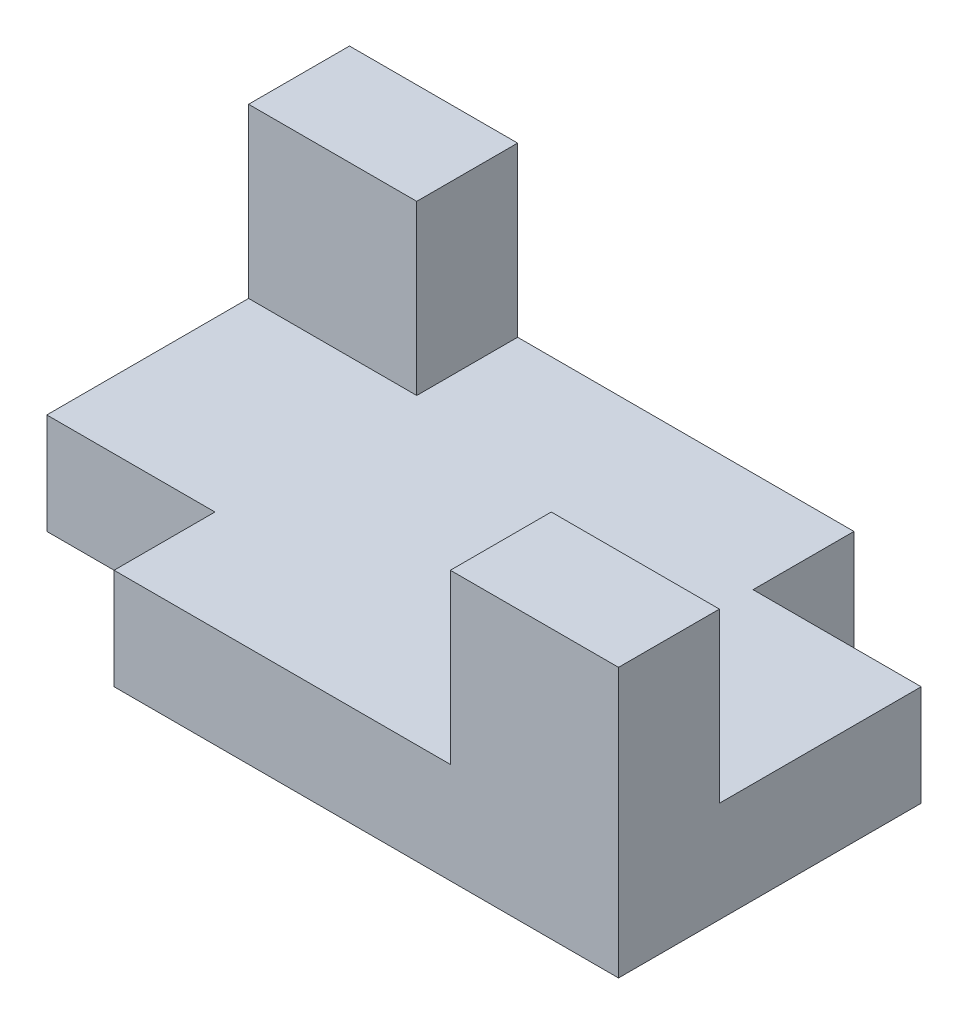
ISO-10303-21;
HEADER;
FILE_DESCRIPTION(('STEP AP214'),'2;1');
FILE_NAME('part.step','',(''),(''),'','','');
FILE_SCHEMA(('AUTOMOTIVE_DESIGN { 1 0 10303 214 1 1 1 1 }'));
ENDSEC;
DATA;
#1=APPLICATION_CONTEXT('core data for automotive mechanical design processes');
#2=APPLICATION_PROTOCOL_DEFINITION('international standard','automotive_design',2000,#1);
#3=PRODUCT_CONTEXT('',#1,'mechanical');
#4=PRODUCT('Part','Part','',(#3));
#5=PRODUCT_RELATED_PRODUCT_CATEGORY('part','',(#4));
#6=PRODUCT_DEFINITION_FORMATION('','',#4);
#7=PRODUCT_DEFINITION_CONTEXT('part definition',#1,'design');
#8=PRODUCT_DEFINITION('design','',#6,#7);
#9=PRODUCT_DEFINITION_SHAPE('','',#8);
#10=(LENGTH_UNIT() NAMED_UNIT(*) SI_UNIT(.MILLI.,.METRE.));
#11=(NAMED_UNIT(*) PLANE_ANGLE_UNIT() SI_UNIT($,.RADIAN.));
#12=(NAMED_UNIT(*) SI_UNIT($,.STERADIAN.) SOLID_ANGLE_UNIT());
#13=UNCERTAINTY_MEASURE_WITH_UNIT(LENGTH_MEASURE(1.E-05),#10,'distance_accuracy_value','');
#14=(GEOMETRIC_REPRESENTATION_CONTEXT(3) GLOBAL_UNCERTAINTY_ASSIGNED_CONTEXT((#13)) GLOBAL_UNIT_ASSIGNED_CONTEXT((#10,
#11,#12)) REPRESENTATION_CONTEXT('',''));
#15=CARTESIAN_POINT('',(0.,0.,0.));
#16=DIRECTION('',(0.,0.,1.));
#17=DIRECTION('',(1.,0.,0.));
#18=AXIS2_PLACEMENT_3D('',#15,#16,#17);
#19=CARTESIAN_POINT('',(0.,15.,0.));
#20=DIRECTION('',(0.,1.,0.));
#21=DIRECTION('',(0.,0.,1.));
#22=AXIS2_PLACEMENT_3D('',#19,#20,#21);
#23=PLANE('',#22);
#24=DIRECTION('',(0.,0.,1.));
#25=VECTOR('',#24,1.);
#26=CARTESIAN_POINT('',(27.681325602062,15.,-13.6260097560087));
#27=LINE('',#26,#25);
#28=CARTESIAN_POINT('',(27.681325602062,15.,-28.6260097560087));
#29=VERTEX_POINT('',#28);
#30=CARTESIAN_POINT('',(27.681325602062,15.,-13.6260097560087));
#31=VERTEX_POINT('',#30);
#32=EDGE_CURVE('E154',#29,#31,#27,.T.);
#33=ORIENTED_EDGE('',*,*,#32,.F.);
#34=DIRECTION('',(-1.,0.,0.));
#35=VECTOR('',#34,1.);
#36=CARTESIAN_POINT('',(-47.318674397938,15.,-28.6260097560087));
#37=LINE('',#36,#35);
#38=CARTESIAN_POINT('',(-22.318674397938,15.,-28.6260097560087));
#39=VERTEX_POINT('',#38);
#40=EDGE_CURVE('E281',#29,#39,#37,.T.);
#41=ORIENTED_EDGE('',*,*,#40,.T.);
#42=DIRECTION('',(0.,0.,-1.));
#43=VECTOR('',#42,1.);
#44=CARTESIAN_POINT('',(-22.318674397938,15.,-13.6260097560087));
#45=LINE('',#44,#43);
#46=CARTESIAN_POINT('',(-22.318674397938,15.,-13.6260097560087));
#47=VERTEX_POINT('',#46);
#48=EDGE_CURVE('E242',#47,#39,#45,.T.);
#49=ORIENTED_EDGE('',*,*,#48,.F.);
#50=DIRECTION('',(-1.,0.,0.));
#51=VECTOR('',#50,1.);
#52=CARTESIAN_POINT('',(-22.318674397938,15.,-13.6260097560087));
#53=LINE('',#52,#51);
#54=CARTESIAN_POINT('',(-47.318674397938,15.,-13.6260097560087));
#55=VERTEX_POINT('',#54);
#56=EDGE_CURVE('E236',#47,#55,#53,.T.);
#57=ORIENTED_EDGE('',*,*,#56,.T.);
#58=DIRECTION('',(0.,0.,1.));
#59=VECTOR('',#58,1.);
#60=CARTESIAN_POINT('',(-47.318674397938,15.,-28.6260097560087));
#61=LINE('',#60,#59);
#62=CARTESIAN_POINT('',(-47.318674397938,15.,16.3739902439913));
#63=VERTEX_POINT('',#62);
#64=EDGE_CURVE('E270',#55,#63,#61,.T.);
#65=ORIENTED_EDGE('',*,*,#64,.T.);
#66=DIRECTION('',(-1.,0.,0.));
#67=VECTOR('',#66,1.);
#68=CARTESIAN_POINT('',(-22.318674397938,15.,16.3739902439913));
#69=LINE('',#68,#67);
#70=CARTESIAN_POINT('',(-22.318674397938,15.,16.3739902439913));
#71=VERTEX_POINT('',#70);
#72=EDGE_CURVE('E188',#71,#63,#69,.T.);
#73=ORIENTED_EDGE('',*,*,#72,.F.);
#74=DIRECTION('',(0.,0.,-1.));
#75=VECTOR('',#74,1.);
#76=CARTESIAN_POINT('',(-22.318674397938,15.,16.3739902439913));
#77=LINE('',#76,#75);
#78=CARTESIAN_POINT('',(-22.318674397938,15.,31.3739902439913));
#79=VERTEX_POINT('',#78);
#80=EDGE_CURVE('E180',#79,#71,#77,.T.);
#81=ORIENTED_EDGE('',*,*,#80,.F.);
#82=DIRECTION('',(1.,0.,0.));
#83=VECTOR('',#82,1.);
#84=CARTESIAN_POINT('',(-47.318674397938,15.,31.3739902439913));
#85=LINE('',#84,#83);
#86=CARTESIAN_POINT('',(27.681325602062,15.,31.3739902439913));
#87=VERTEX_POINT('',#86);
#88=EDGE_CURVE('E274',#79,#87,#85,.T.);
#89=ORIENTED_EDGE('',*,*,#88,.T.);
#90=DIRECTION('',(0.,0.,1.));
#91=VECTOR('',#90,1.);
#92=CARTESIAN_POINT('',(27.681325602062,15.,16.3739902439913));
#93=LINE('',#92,#91);
#94=CARTESIAN_POINT('',(27.681325602062,15.,16.3739902439913));
#95=VERTEX_POINT('',#94);
#96=EDGE_CURVE('E200',#95,#87,#93,.T.);
#97=ORIENTED_EDGE('',*,*,#96,.F.);
#98=DIRECTION('',(-1.,0.,0.));
#99=VECTOR('',#98,1.);
#100=CARTESIAN_POINT('',(27.681325602062,15.,16.3739902439913));
#101=LINE('',#100,#99);
#102=CARTESIAN_POINT('',(52.6813256020621,15.,16.3739902439913));
#103=VERTEX_POINT('',#102);
#104=EDGE_CURVE('E210',#103,#95,#101,.T.);
#105=ORIENTED_EDGE('',*,*,#104,.F.);
#106=DIRECTION('',(0.,0.,-1.));
#107=VECTOR('',#106,1.);
#108=CARTESIAN_POINT('',(52.681325602062,15.,-28.6260097560087));
#109=LINE('',#108,#107);
#110=CARTESIAN_POINT('',(52.681325602062,15.,-13.6260097560087));
#111=VERTEX_POINT('',#110);
#112=EDGE_CURVE('E277',#103,#111,#109,.T.);
#113=ORIENTED_EDGE('',*,*,#112,.T.);
#114=DIRECTION('',(1.,0.,0.));
#115=VECTOR('',#114,1.);
#116=CARTESIAN_POINT('',(27.681325602062,15.,-13.6260097560087));
#117=LINE('',#116,#115);
#118=EDGE_CURVE('E170',#31,#111,#117,.T.);
#119=ORIENTED_EDGE('',*,*,#118,.F.);
#120=EDGE_LOOP('',(#33,#41,#49,#57,#65,#73,#81,#89,#97,#105,#113,#119));
#121=FACE_BOUND('',#120,.T.);
#122=ADVANCED_FACE('F45',(#121),#23,.T.);
#123=CARTESIAN_POINT('',(-47.318674397938,15.,-28.6260097560087));
#124=DIRECTION('',(1.,0.,0.));
#125=DIRECTION('',(0.,0.,-1.));
#126=AXIS2_PLACEMENT_3D('',#123,#124,#125);
#127=PLANE('',#126);
#128=DIRECTION('',(0.,0.,1.));
#129=VECTOR('',#128,1.);
#130=CARTESIAN_POINT('',(-47.318674397938,0.,-28.6260097560087));
#131=LINE('',#130,#129);
#132=CARTESIAN_POINT('',(-47.318674397938,0.,-28.6260097560087));
#133=VERTEX_POINT('',#132);
#134=CARTESIAN_POINT('',(-47.318674397938,0.,16.3739902439913));
#135=VERTEX_POINT('',#134);
#136=EDGE_CURVE('E269',#133,#135,#131,.T.);
#137=ORIENTED_EDGE('',*,*,#136,.T.);
#138=DIRECTION('',(0.,1.,0.));
#139=VECTOR('',#138,1.);
#140=CARTESIAN_POINT('',(-47.318674397938,0.,16.3739902439913));
#141=LINE('',#140,#139);
#142=EDGE_CURVE('E69',#135,#63,#141,.T.);
#143=ORIENTED_EDGE('',*,*,#142,.T.);
#144=ORIENTED_EDGE('',*,*,#64,.F.);
#145=DIRECTION('',(0.,-1.,0.));
#146=VECTOR('',#145,1.);
#147=CARTESIAN_POINT('',(-47.318674397938,40.,-13.6260097560087));
#148=LINE('',#147,#146);
#149=CARTESIAN_POINT('',(-47.318674397938,40.,-13.6260097560087));
#150=VERTEX_POINT('',#149);
#151=EDGE_CURVE('E266',#150,#55,#148,.T.);
#152=ORIENTED_EDGE('',*,*,#151,.F.);
#153=DIRECTION('',(0.,0.,-1.));
#154=VECTOR('',#153,1.);
#155=CARTESIAN_POINT('',(-47.318674397938,40.,-13.6260097560087));
#156=LINE('',#155,#154);
#157=CARTESIAN_POINT('',(-47.318674397938,40.,-28.6260097560087));
#158=VERTEX_POINT('',#157);
#159=EDGE_CURVE('E241',#150,#158,#156,.T.);
#160=ORIENTED_EDGE('',*,*,#159,.T.);
#161=DIRECTION('',(0.,-1.,0.));
#162=VECTOR('',#161,1.);
#163=CARTESIAN_POINT('',(-47.318674397938,15.,-28.6260097560087));
#164=LINE('',#163,#162);
#165=EDGE_CURVE('E54',#158,#133,#164,.T.);
#166=ORIENTED_EDGE('',*,*,#165,.T.);
#167=EDGE_LOOP('',(#137,#143,#144,#152,#160,#166));
#168=FACE_BOUND('',#167,.T.);
#169=ADVANCED_FACE('F47',(#168),#127,.F.);
#170=CARTESIAN_POINT('',(-47.318674397938,15.,31.3739902439913));
#171=DIRECTION('',(0.,0.,-1.));
#172=DIRECTION('',(-1.,0.,0.));
#173=AXIS2_PLACEMENT_3D('',#170,#171,#172);
#174=PLANE('',#173);
#175=ORIENTED_EDGE('',*,*,#88,.F.);
#176=DIRECTION('',(0.,1.,0.));
#177=VECTOR('',#176,1.);
#178=CARTESIAN_POINT('',(-22.318674397938,0.,31.3739902439913));
#179=LINE('',#178,#177);
#180=CARTESIAN_POINT('',(-22.318674397938,0.,31.3739902439913));
#181=VERTEX_POINT('',#180);
#182=EDGE_CURVE('E197',#181,#79,#179,.T.);
#183=ORIENTED_EDGE('',*,*,#182,.F.);
#184=DIRECTION('',(1.,0.,0.));
#185=VECTOR('',#184,1.);
#186=CARTESIAN_POINT('',(-47.318674397938,0.,31.3739902439913));
#187=LINE('',#186,#185);
#188=CARTESIAN_POINT('',(52.6813256020621,0.,31.3739902439913));
#189=VERTEX_POINT('',#188);
#190=EDGE_CURVE('E287',#181,#189,#187,.T.);
#191=ORIENTED_EDGE('',*,*,#190,.T.);
#192=DIRECTION('',(0.,-1.,0.));
#193=VECTOR('',#192,1.);
#194=CARTESIAN_POINT('',(52.6813256020621,15.,31.3739902439913));
#195=LINE('',#194,#193);
#196=CARTESIAN_POINT('',(52.6813256020621,40.,31.3739902439913));
#197=VERTEX_POINT('',#196);
#198=EDGE_CURVE('E11',#197,#189,#195,.T.);
#199=ORIENTED_EDGE('',*,*,#198,.F.);
#200=DIRECTION('',(1.,0.,0.));
#201=VECTOR('',#200,1.);
#202=CARTESIAN_POINT('',(27.681325602062,40.,31.3739902439913));
#203=LINE('',#202,#201);
#204=CARTESIAN_POINT('',(27.681325602062,40.,31.3739902439913));
#205=VERTEX_POINT('',#204);
#206=EDGE_CURVE('E209',#205,#197,#203,.T.);
#207=ORIENTED_EDGE('',*,*,#206,.F.);
#208=DIRECTION('',(0.,-1.,0.));
#209=VECTOR('',#208,1.);
#210=CARTESIAN_POINT('',(27.681325602062,40.,31.3739902439913));
#211=LINE('',#210,#209);
#212=EDGE_CURVE('E232',#205,#87,#211,.T.);
#213=ORIENTED_EDGE('',*,*,#212,.T.);
#214=EDGE_LOOP('',(#175,#183,#191,#199,#207,#213));
#215=FACE_BOUND('',#214,.T.);
#216=ADVANCED_FACE('F331',(#215),#174,.F.);
#217=CARTESIAN_POINT('',(52.681325602062,15.,-28.6260097560087));
#218=DIRECTION('',(-1.,0.,0.));
#219=DIRECTION('',(0.,0.,1.));
#220=AXIS2_PLACEMENT_3D('',#217,#218,#219);
#221=PLANE('',#220);
#222=DIRECTION('',(0.,0.,-1.));
#223=VECTOR('',#222,1.);
#224=CARTESIAN_POINT('',(52.681325602062,0.,-28.6260097560087));
#225=LINE('',#224,#223);
#226=CARTESIAN_POINT('',(52.681325602062,0.,-13.6260097560087));
#227=VERTEX_POINT('',#226);
#228=EDGE_CURVE('E290',#189,#227,#225,.T.);
#229=ORIENTED_EDGE('',*,*,#228,.T.);
#230=DIRECTION('',(0.,1.,0.));
#231=VECTOR('',#230,1.);
#232=CARTESIAN_POINT('',(52.681325602062,0.,-13.6260097560087));
#233=LINE('',#232,#231);
#234=EDGE_CURVE('E61',#227,#111,#233,.T.);
#235=ORIENTED_EDGE('',*,*,#234,.T.);
#236=ORIENTED_EDGE('',*,*,#112,.F.);
#237=DIRECTION('',(0.,-1.,0.));
#238=VECTOR('',#237,1.);
#239=CARTESIAN_POINT('',(52.681325602062,40.,16.3739902439913));
#240=LINE('',#239,#238);
#241=CARTESIAN_POINT('',(52.681325602062,40.,16.3739902439913));
#242=VERTEX_POINT('',#241);
#243=EDGE_CURVE('E229',#242,#103,#240,.T.);
#244=ORIENTED_EDGE('',*,*,#243,.F.);
#245=DIRECTION('',(0.,0.,-1.));
#246=VECTOR('',#245,1.);
#247=CARTESIAN_POINT('',(52.681325602062,40.,16.3739902439913));
#248=LINE('',#247,#246);
#249=EDGE_CURVE('E214',#197,#242,#248,.T.);
#250=ORIENTED_EDGE('',*,*,#249,.F.);
#251=ORIENTED_EDGE('',*,*,#198,.T.);
#252=EDGE_LOOP('',(#229,#235,#236,#244,#250,#251));
#253=FACE_BOUND('',#252,.T.);
#254=ADVANCED_FACE('F324',(#253),#221,.F.);
#255=CARTESIAN_POINT('',(-47.318674397938,15.,-28.6260097560087));
#256=DIRECTION('',(0.,0.,1.));
#257=DIRECTION('',(1.,0.,0.));
#258=AXIS2_PLACEMENT_3D('',#255,#256,#257);
#259=PLANE('',#258);
#260=ORIENTED_EDGE('',*,*,#40,.F.);
#261=DIRECTION('',(0.,1.,0.));
#262=VECTOR('',#261,1.);
#263=CARTESIAN_POINT('',(27.681325602062,0.,-28.6260097560087));
#264=LINE('',#263,#262);
#265=CARTESIAN_POINT('',(27.681325602062,0.,-28.6260097560087));
#266=VERTEX_POINT('',#265);
#267=EDGE_CURVE('E177',#266,#29,#264,.T.);
#268=ORIENTED_EDGE('',*,*,#267,.F.);
#269=DIRECTION('',(-1.,0.,0.));
#270=VECTOR('',#269,1.);
#271=CARTESIAN_POINT('',(-47.318674397938,0.,-28.6260097560087));
#272=LINE('',#271,#270);
#273=EDGE_CURVE('E168',#266,#133,#272,.T.);
#274=ORIENTED_EDGE('',*,*,#273,.T.);
#275=ORIENTED_EDGE('',*,*,#165,.F.);
#276=DIRECTION('',(-1.,0.,0.));
#277=VECTOR('',#276,1.);
#278=CARTESIAN_POINT('',(-22.318674397938,40.,-28.6260097560087));
#279=LINE('',#278,#277);
#280=CARTESIAN_POINT('',(-22.318674397938,40.,-28.6260097560087));
#281=VERTEX_POINT('',#280);
#282=EDGE_CURVE('E237',#281,#158,#279,.T.);
#283=ORIENTED_EDGE('',*,*,#282,.F.);
#284=DIRECTION('',(0.,-1.,0.));
#285=VECTOR('',#284,1.);
#286=CARTESIAN_POINT('',(-22.318674397938,40.,-28.6260097560087));
#287=LINE('',#286,#285);
#288=EDGE_CURVE('E253',#281,#39,#287,.T.);
#289=ORIENTED_EDGE('',*,*,#288,.T.);
#290=EDGE_LOOP('',(#260,#268,#274,#275,#283,#289));
#291=FACE_BOUND('',#290,.T.);
#292=ADVANCED_FACE('F322',(#291),#259,.F.);
#293=CARTESIAN_POINT('',(0.,0.,0.));
#294=DIRECTION('',(0.,1.,0.));
#295=DIRECTION('',(0.,0.,1.));
#296=AXIS2_PLACEMENT_3D('',#293,#294,#295);
#297=PLANE('',#296);
#298=ORIENTED_EDGE('',*,*,#273,.F.);
#299=DIRECTION('',(0.,0.,1.));
#300=VECTOR('',#299,1.);
#301=CARTESIAN_POINT('',(27.681325602062,0.,-13.6260097560087));
#302=LINE('',#301,#300);
#303=CARTESIAN_POINT('',(27.681325602062,0.,-13.6260097560087));
#304=VERTEX_POINT('',#303);
#305=EDGE_CURVE('E151',#266,#304,#302,.T.);
#306=ORIENTED_EDGE('',*,*,#305,.T.);
#307=DIRECTION('',(1.,0.,0.));
#308=VECTOR('',#307,1.);
#309=CARTESIAN_POINT('',(27.681325602062,0.,-13.6260097560087));
#310=LINE('',#309,#308);
#311=EDGE_CURVE('E157',#304,#227,#310,.T.);
#312=ORIENTED_EDGE('',*,*,#311,.T.);
#313=ORIENTED_EDGE('',*,*,#228,.F.);
#314=ORIENTED_EDGE('',*,*,#190,.F.);
#315=DIRECTION('',(0.,0.,-1.));
#316=VECTOR('',#315,1.);
#317=CARTESIAN_POINT('',(-22.318674397938,0.,16.3739902439913));
#318=LINE('',#317,#316);
#319=CARTESIAN_POINT('',(-22.318674397938,0.,16.3739902439913));
#320=VERTEX_POINT('',#319);
#321=EDGE_CURVE('E183',#181,#320,#318,.T.);
#322=ORIENTED_EDGE('',*,*,#321,.T.);
#323=DIRECTION('',(-1.,0.,0.));
#324=VECTOR('',#323,1.);
#325=CARTESIAN_POINT('',(-22.318674397938,0.,16.3739902439913));
#326=LINE('',#325,#324);
#327=EDGE_CURVE('E187',#320,#135,#326,.T.);
#328=ORIENTED_EDGE('',*,*,#327,.T.);
#329=ORIENTED_EDGE('',*,*,#136,.F.);
#330=EDGE_LOOP('',(#298,#306,#312,#313,#314,#322,#328,#329));
#331=FACE_BOUND('',#330,.T.);
#332=ADVANCED_FACE('F166',(#331),#297,.F.);
#333=CARTESIAN_POINT('',(-22.318674397938,40.,-13.6260097560087));
#334=DIRECTION('',(0.,0.,1.));
#335=DIRECTION('',(1.,0.,0.));
#336=AXIS2_PLACEMENT_3D('',#333,#334,#335);
#337=PLANE('',#336);
#338=ORIENTED_EDGE('',*,*,#56,.F.);
#339=DIRECTION('',(0.,-1.,0.));
#340=VECTOR('',#339,1.);
#341=CARTESIAN_POINT('',(-22.318674397938,40.,-13.6260097560087));
#342=LINE('',#341,#340);
#343=CARTESIAN_POINT('',(-22.318674397938,40.,-13.6260097560087));
#344=VERTEX_POINT('',#343);
#345=EDGE_CURVE('E263',#344,#47,#342,.T.);
#346=ORIENTED_EDGE('',*,*,#345,.F.);
#347=DIRECTION('',(-1.,0.,0.));
#348=VECTOR('',#347,1.);
#349=CARTESIAN_POINT('',(-22.318674397938,40.,-13.6260097560087));
#350=LINE('',#349,#348);
#351=EDGE_CURVE('E246',#344,#150,#350,.T.);
#352=ORIENTED_EDGE('',*,*,#351,.T.);
#353=ORIENTED_EDGE('',*,*,#151,.T.);
#354=EDGE_LOOP('',(#338,#346,#352,#353));
#355=FACE_BOUND('',#354,.T.);
#356=ADVANCED_FACE('F316',(#355),#337,.T.);
#357=CARTESIAN_POINT('',(-22.318674397938,40.,-13.6260097560087));
#358=DIRECTION('',(-1.,0.,0.));
#359=DIRECTION('',(0.,0.,1.));
#360=AXIS2_PLACEMENT_3D('',#357,#358,#359);
#361=PLANE('',#360);
#362=ORIENTED_EDGE('',*,*,#48,.T.);
#363=ORIENTED_EDGE('',*,*,#288,.F.);
#364=DIRECTION('',(0.,0.,-1.));
#365=VECTOR('',#364,1.);
#366=CARTESIAN_POINT('',(-22.318674397938,40.,-13.6260097560087));
#367=LINE('',#366,#365);
#368=EDGE_CURVE('E250',#344,#281,#367,.T.);
#369=ORIENTED_EDGE('',*,*,#368,.F.);
#370=ORIENTED_EDGE('',*,*,#345,.T.);
#371=EDGE_LOOP('',(#362,#363,#369,#370));
#372=FACE_BOUND('',#371,.T.);
#373=ADVANCED_FACE('F320',(#372),#361,.F.);
#374=CARTESIAN_POINT('',(0.,40.,0.));
#375=DIRECTION('',(0.,-1.,0.));
#376=DIRECTION('',(0.,0.,-1.));
#377=AXIS2_PLACEMENT_3D('',#374,#375,#376);
#378=PLANE('',#377);
#379=ORIENTED_EDGE('',*,*,#282,.T.);
#380=ORIENTED_EDGE('',*,*,#159,.F.);
#381=ORIENTED_EDGE('',*,*,#351,.F.);
#382=ORIENTED_EDGE('',*,*,#368,.T.);
#383=EDGE_LOOP('',(#379,#380,#381,#382));
#384=FACE_BOUND('',#383,.T.);
#385=ADVANCED_FACE('F315',(#384),#378,.F.);
#386=CARTESIAN_POINT('',(27.681325602062,40.,16.3739902439913));
#387=DIRECTION('',(1.,0.,0.));
#388=DIRECTION('',(0.,0.,-1.));
#389=AXIS2_PLACEMENT_3D('',#386,#387,#388);
#390=PLANE('',#389);
#391=ORIENTED_EDGE('',*,*,#96,.T.);
#392=ORIENTED_EDGE('',*,*,#212,.F.);
#393=DIRECTION('',(0.,0.,1.));
#394=VECTOR('',#393,1.);
#395=CARTESIAN_POINT('',(27.681325602062,40.,16.3739902439913));
#396=LINE('',#395,#394);
#397=CARTESIAN_POINT('',(27.681325602062,40.,16.3739902439913));
#398=VERTEX_POINT('',#397);
#399=EDGE_CURVE('E205',#398,#205,#396,.T.);
#400=ORIENTED_EDGE('',*,*,#399,.F.);
#401=DIRECTION('',(0.,-1.,0.));
#402=VECTOR('',#401,1.);
#403=CARTESIAN_POINT('',(27.681325602062,40.,16.3739902439913));
#404=LINE('',#403,#402);
#405=EDGE_CURVE('E220',#398,#95,#404,.T.);
#406=ORIENTED_EDGE('',*,*,#405,.T.);
#407=EDGE_LOOP('',(#391,#392,#400,#406));
#408=FACE_BOUND('',#407,.T.);
#409=ADVANCED_FACE('F347',(#408),#390,.F.);
#410=CARTESIAN_POINT('',(27.681325602062,40.,16.3739902439913));
#411=DIRECTION('',(0.,0.,1.));
#412=DIRECTION('',(1.,0.,0.));
#413=AXIS2_PLACEMENT_3D('',#410,#411,#412);
#414=PLANE('',#413);
#415=ORIENTED_EDGE('',*,*,#104,.T.);
#416=ORIENTED_EDGE('',*,*,#405,.F.);
#417=DIRECTION('',(-1.,0.,0.));
#418=VECTOR('',#417,1.);
#419=CARTESIAN_POINT('',(27.681325602062,40.,16.3739902439913));
#420=LINE('',#419,#418);
#421=EDGE_CURVE('E217',#242,#398,#420,.T.);
#422=ORIENTED_EDGE('',*,*,#421,.F.);
#423=ORIENTED_EDGE('',*,*,#243,.T.);
#424=EDGE_LOOP('',(#415,#416,#422,#423));
#425=FACE_BOUND('',#424,.T.);
#426=ADVANCED_FACE('F350',(#425),#414,.F.);
#427=CARTESIAN_POINT('',(0.,40.,0.));
#428=DIRECTION('',(0.,1.,0.));
#429=DIRECTION('',(0.,0.,1.));
#430=AXIS2_PLACEMENT_3D('',#427,#428,#429);
#431=PLANE('',#430);
#432=ORIENTED_EDGE('',*,*,#399,.T.);
#433=ORIENTED_EDGE('',*,*,#206,.T.);
#434=ORIENTED_EDGE('',*,*,#249,.T.);
#435=ORIENTED_EDGE('',*,*,#421,.T.);
#436=EDGE_LOOP('',(#432,#433,#434,#435));
#437=FACE_BOUND('',#436,.T.);
#438=ADVANCED_FACE('F354',(#437),#431,.T.);
#439=CARTESIAN_POINT('',(-22.318674397938,0.,16.3739902439913));
#440=DIRECTION('',(1.,0.,0.));
#441=DIRECTION('',(0.,0.,-1.));
#442=AXIS2_PLACEMENT_3D('',#439,#440,#441);
#443=PLANE('',#442);
#444=ORIENTED_EDGE('',*,*,#80,.T.);
#445=DIRECTION('',(0.,1.,0.));
#446=VECTOR('',#445,1.);
#447=CARTESIAN_POINT('',(-22.318674397938,0.,16.3739902439913));
#448=LINE('',#447,#446);
#449=EDGE_CURVE('E191',#320,#71,#448,.T.);
#450=ORIENTED_EDGE('',*,*,#449,.F.);
#451=ORIENTED_EDGE('',*,*,#321,.F.);
#452=ORIENTED_EDGE('',*,*,#182,.T.);
#453=EDGE_LOOP('',(#444,#450,#451,#452));
#454=FACE_BOUND('',#453,.T.);
#455=ADVANCED_FACE('F305',(#454),#443,.F.);
#456=CARTESIAN_POINT('',(-22.318674397938,0.,16.3739902439913));
#457=DIRECTION('',(0.,0.,-1.));
#458=DIRECTION('',(-1.,0.,0.));
#459=AXIS2_PLACEMENT_3D('',#456,#457,#458);
#460=PLANE('',#459);
#461=ORIENTED_EDGE('',*,*,#72,.T.);
#462=ORIENTED_EDGE('',*,*,#142,.F.);
#463=ORIENTED_EDGE('',*,*,#327,.F.);
#464=ORIENTED_EDGE('',*,*,#449,.T.);
#465=EDGE_LOOP('',(#461,#462,#463,#464));
#466=FACE_BOUND('',#465,.T.);
#467=ADVANCED_FACE('F301',(#466),#460,.F.);
#468=CARTESIAN_POINT('',(27.681325602062,0.,-13.6260097560087));
#469=DIRECTION('',(-1.,0.,0.));
#470=DIRECTION('',(0.,0.,1.));
#471=AXIS2_PLACEMENT_3D('',#468,#469,#470);
#472=PLANE('',#471);
#473=ORIENTED_EDGE('',*,*,#32,.T.);
#474=DIRECTION('',(0.,1.,0.));
#475=VECTOR('',#474,1.);
#476=CARTESIAN_POINT('',(27.681325602062,0.,-13.6260097560087));
#477=LINE('',#476,#475);
#478=EDGE_CURVE('E148',#304,#31,#477,.T.);
#479=ORIENTED_EDGE('',*,*,#478,.F.);
#480=ORIENTED_EDGE('',*,*,#305,.F.);
#481=ORIENTED_EDGE('',*,*,#267,.T.);
#482=EDGE_LOOP('',(#473,#479,#480,#481));
#483=FACE_BOUND('',#482,.T.);
#484=ADVANCED_FACE('F149',(#483),#472,.F.);
#485=CARTESIAN_POINT('',(27.681325602062,0.,-13.6260097560087));
#486=DIRECTION('',(0.,0.,1.));
#487=DIRECTION('',(1.,0.,0.));
#488=AXIS2_PLACEMENT_3D('',#485,#486,#487);
#489=PLANE('',#488);
#490=ORIENTED_EDGE('',*,*,#118,.T.);
#491=ORIENTED_EDGE('',*,*,#234,.F.);
#492=ORIENTED_EDGE('',*,*,#311,.F.);
#493=ORIENTED_EDGE('',*,*,#478,.T.);
#494=EDGE_LOOP('',(#490,#491,#492,#493));
#495=FACE_BOUND('',#494,.T.);
#496=ADVANCED_FACE('F159',(#495),#489,.F.);
#497=CLOSED_SHELL('',(#122,#169,#216,#254,#292,#332,#356,#373,#385,#409,#426,#438,#455,#467,
#484,#496));
#498=MANIFOLD_SOLID_BREP('B2',#497);
#499=ADVANCED_BREP_SHAPE_REPRESENTATION('',(#18,#498),#14);
#500=SHAPE_DEFINITION_REPRESENTATION(#9,#499);
ENDSEC;
END-ISO-10303-21;
